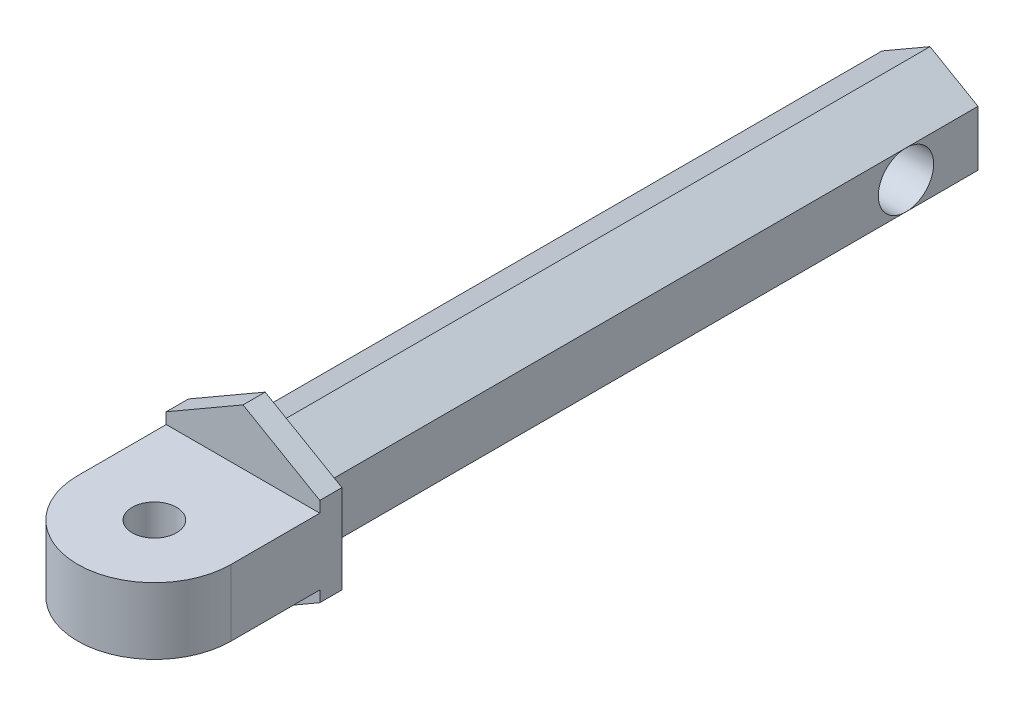
ISO-10303-21;
HEADER;
FILE_DESCRIPTION(('STEP AP214'),'2;1');
FILE_NAME('part.step','',(''),(''),'','','');
FILE_SCHEMA(('AUTOMOTIVE_DESIGN { 1 0 10303 214 1 1 1 1 }'));
ENDSEC;
DATA;
#1=APPLICATION_CONTEXT('core data for automotive mechanical design processes');
#2=APPLICATION_PROTOCOL_DEFINITION('international standard','automotive_design',2000,#1);
#3=PRODUCT_CONTEXT('',#1,'mechanical');
#4=PRODUCT('Part','Part','',(#3));
#5=PRODUCT_RELATED_PRODUCT_CATEGORY('part','',(#4));
#6=PRODUCT_DEFINITION_FORMATION('','',#4);
#7=PRODUCT_DEFINITION_CONTEXT('part definition',#1,'design');
#8=PRODUCT_DEFINITION('design','',#6,#7);
#9=PRODUCT_DEFINITION_SHAPE('','',#8);
#10=(LENGTH_UNIT() NAMED_UNIT(*) SI_UNIT(.MILLI.,.METRE.));
#11=(NAMED_UNIT(*) PLANE_ANGLE_UNIT() SI_UNIT($,.RADIAN.));
#12=(NAMED_UNIT(*) SI_UNIT($,.STERADIAN.) SOLID_ANGLE_UNIT());
#13=UNCERTAINTY_MEASURE_WITH_UNIT(LENGTH_MEASURE(1.E-05),#10,'distance_accuracy_value','');
#14=(GEOMETRIC_REPRESENTATION_CONTEXT(3) GLOBAL_UNCERTAINTY_ASSIGNED_CONTEXT((#13)) GLOBAL_UNIT_ASSIGNED_CONTEXT((#10,
#11,#12)) REPRESENTATION_CONTEXT('',''));
#15=CARTESIAN_POINT('',(0.,0.,0.));
#16=DIRECTION('',(0.,0.,1.));
#17=DIRECTION('',(1.,0.,0.));
#18=AXIS2_PLACEMENT_3D('',#15,#16,#17);
#19=CARTESIAN_POINT('',(2.1650635094611,1.25,-30.));
#20=DIRECTION('',(-1.,0.,0.));
#21=DIRECTION('',(0.,-1.,0.));
#22=AXIS2_PLACEMENT_3D('',#19,#20,#21);
#23=PLANE('',#22);
#24=DIRECTION('',(0.,0.,1.));
#25=VECTOR('',#24,1.);
#26=CARTESIAN_POINT('',(2.1650635094611,-1.25,-30.));
#27=LINE('',#26,#25);
#28=CARTESIAN_POINT('',(2.1650635094611,-1.25,-26.75));
#29=VERTEX_POINT('',#28);
#30=CARTESIAN_POINT('',(2.1650635094611,-1.25,0.));
#31=VERTEX_POINT('',#30);
#32=EDGE_CURVE('E166',#29,#31,#27,.T.);
#33=ORIENTED_EDGE('',*,*,#32,.F.);
#34=CARTESIAN_POINT('',(2.1650635094611,0.,-26.75));
#35=DIRECTION('',(-1.,0.,0.));
#36=DIRECTION('',(0.,-1.,0.));
#37=AXIS2_PLACEMENT_3D('',#34,#35,#36);
#38=CIRCLE('',#37,1.25);
#39=CARTESIAN_POINT('',(2.1650635094611,1.25,-26.75));
#40=VERTEX_POINT('',#39);
#41=EDGE_CURVE('E46',#40,#29,#38,.F.);
#42=ORIENTED_EDGE('',*,*,#41,.F.);
#43=DIRECTION('',(0.,0.,1.));
#44=VECTOR('',#43,1.);
#45=CARTESIAN_POINT('',(2.1650635094611,1.25,-30.));
#46=LINE('',#45,#44);
#47=CARTESIAN_POINT('',(2.1650635094611,1.25,0.));
#48=VERTEX_POINT('',#47);
#49=EDGE_CURVE('E164',#40,#48,#46,.T.);
#50=ORIENTED_EDGE('',*,*,#49,.T.);
#51=DIRECTION('',(0.,-1.,0.));
#52=VECTOR('',#51,1.);
#53=CARTESIAN_POINT('',(2.1650635094611,1.25,0.));
#54=LINE('',#53,#52);
#55=EDGE_CURVE('E514',#48,#31,#54,.T.);
#56=ORIENTED_EDGE('',*,*,#55,.T.);
#57=EDGE_LOOP('',(#33,#42,#50,#56));
#58=FACE_BOUND('',#57,.T.);
#59=ADVANCED_FACE('F32',(#58),#23,.F.);
#60=CARTESIAN_POINT('',(-2.1650635094611,-1.25,-30.));
#61=DIRECTION('',(1.,0.,0.));
#62=DIRECTION('',(0.,1.,0.));
#63=AXIS2_PLACEMENT_3D('',#60,#61,#62);
#64=PLANE('',#63);
#65=DIRECTION('',(0.,0.,1.));
#66=VECTOR('',#65,1.);
#67=CARTESIAN_POINT('',(-2.1650635094611,1.25,-30.));
#68=LINE('',#67,#66);
#69=CARTESIAN_POINT('',(-2.1650635094611,1.25,-26.75));
#70=VERTEX_POINT('',#69);
#71=CARTESIAN_POINT('',(-2.1650635094611,1.25,0.));
#72=VERTEX_POINT('',#71);
#73=EDGE_CURVE('E503',#70,#72,#68,.T.);
#74=ORIENTED_EDGE('',*,*,#73,.F.);
#75=CARTESIAN_POINT('',(-2.1650635094611,0.,-26.75));
#76=DIRECTION('',(-1.,0.,0.));
#77=DIRECTION('',(0.,-1.,0.));
#78=AXIS2_PLACEMENT_3D('',#75,#76,#77);
#79=CIRCLE('',#78,1.25);
#80=CARTESIAN_POINT('',(-2.1650635094611,-1.25,-26.75));
#81=VERTEX_POINT('',#80);
#82=EDGE_CURVE('E53',#81,#70,#79,.T.);
#83=ORIENTED_EDGE('',*,*,#82,.F.);
#84=DIRECTION('',(0.,0.,1.));
#85=VECTOR('',#84,1.);
#86=CARTESIAN_POINT('',(-2.1650635094611,-1.25,-30.));
#87=LINE('',#86,#85);
#88=CARTESIAN_POINT('',(-2.1650635094611,-1.25,0.));
#89=VERTEX_POINT('',#88);
#90=EDGE_CURVE('E496',#81,#89,#87,.T.);
#91=ORIENTED_EDGE('',*,*,#90,.T.);
#92=DIRECTION('',(0.,1.,0.));
#93=VECTOR('',#92,1.);
#94=CARTESIAN_POINT('',(-2.1650635094611,-1.25,0.));
#95=LINE('',#94,#93);
#96=EDGE_CURVE('E504',#89,#72,#95,.T.);
#97=ORIENTED_EDGE('',*,*,#96,.T.);
#98=EDGE_LOOP('',(#74,#83,#91,#97));
#99=FACE_BOUND('',#98,.T.);
#100=ADVANCED_FACE('F320',(#99),#64,.F.);
#101=CARTESIAN_POINT('',(0.,0.,0.));
#102=DIRECTION('',(0.,0.,1.));
#103=DIRECTION('',(1.,0.,0.));
#104=AXIS2_PLACEMENT_3D('',#101,#102,#103);
#105=PLANE('',#104);
#106=DIRECTION('',(0.,1.,0.));
#107=VECTOR('',#106,1.);
#108=CARTESIAN_POINT('',(3.46410161513776,-1.99999999999999,0.));
#109=LINE('',#108,#107);
#110=CARTESIAN_POINT('',(3.46410161513776,-1.99999999999999,0.));
#111=VERTEX_POINT('',#110);
#112=CARTESIAN_POINT('',(3.46410161513775,2.00000000000001,0.));
#113=VERTEX_POINT('',#112);
#114=EDGE_CURVE('E215',#111,#113,#109,.T.);
#115=ORIENTED_EDGE('',*,*,#114,.F.);
#116=DIRECTION('',(0.866025403784436,0.500000000000004,0.));
#117=VECTOR('',#116,1.);
#118=CARTESIAN_POINT('',(0.,-4.,0.));
#119=LINE('',#118,#117);
#120=CARTESIAN_POINT('',(0.,-4.,0.));
#121=VERTEX_POINT('',#120);
#122=EDGE_CURVE('E244',#121,#111,#119,.T.);
#123=ORIENTED_EDGE('',*,*,#122,.F.);
#124=DIRECTION('',(0.866025403784441,-0.499999999999995,0.));
#125=VECTOR('',#124,1.);
#126=CARTESIAN_POINT('',(-3.46410161513775,-2.00000000000001,0.));
#127=LINE('',#126,#125);
#128=CARTESIAN_POINT('',(-3.46410161513775,-2.00000000000001,0.));
#129=VERTEX_POINT('',#128);
#130=EDGE_CURVE('E242',#129,#121,#127,.T.);
#131=ORIENTED_EDGE('',*,*,#130,.F.);
#132=DIRECTION('',(0.,-1.,0.));
#133=VECTOR('',#132,1.);
#134=CARTESIAN_POINT('',(-3.46410161513776,1.99999999999999,0.));
#135=LINE('',#134,#133);
#136=CARTESIAN_POINT('',(-3.46410161513776,1.99999999999999,0.));
#137=VERTEX_POINT('',#136);
#138=EDGE_CURVE('E240',#137,#129,#135,.T.);
#139=ORIENTED_EDGE('',*,*,#138,.F.);
#140=DIRECTION('',(-0.866025403784438,-0.500000000000001,0.));
#141=VECTOR('',#140,1.);
#142=CARTESIAN_POINT('',(0.,4.,0.));
#143=LINE('',#142,#141);
#144=CARTESIAN_POINT('',(0.,4.,0.));
#145=VERTEX_POINT('',#144);
#146=EDGE_CURVE('E238',#145,#137,#143,.T.);
#147=ORIENTED_EDGE('',*,*,#146,.F.);
#148=DIRECTION('',(-0.86602540378444,0.499999999999998,0.));
#149=VECTOR('',#148,1.);
#150=CARTESIAN_POINT('',(3.46410161513775,2.00000000000001,0.));
#151=LINE('',#150,#149);
#152=EDGE_CURVE('E236',#113,#145,#151,.T.);
#153=ORIENTED_EDGE('',*,*,#152,.F.);
#154=EDGE_LOOP('',(#115,#123,#131,#139,#147,#153));
#155=FACE_BOUND('',#154,.T.);
#156=DIRECTION('',(0.866025403784439,0.5,0.));
#157=VECTOR('',#156,1.);
#158=CARTESIAN_POINT('',(-2.1650635094611,1.25,0.));
#159=LINE('',#158,#157);
#160=CARTESIAN_POINT('',(0.,2.5,0.));
#161=VERTEX_POINT('',#160);
#162=EDGE_CURVE('E159',#72,#161,#159,.T.);
#163=ORIENTED_EDGE('',*,*,#162,.F.);
#164=ORIENTED_EDGE('',*,*,#96,.F.);
#165=DIRECTION('',(-0.866025403784439,0.5,0.));
#166=VECTOR('',#165,1.);
#167=CARTESIAN_POINT('',(0.,-2.5,0.));
#168=LINE('',#167,#166);
#169=CARTESIAN_POINT('',(0.,-2.5,0.));
#170=VERTEX_POINT('',#169);
#171=EDGE_CURVE('E508',#170,#89,#168,.T.);
#172=ORIENTED_EDGE('',*,*,#171,.F.);
#173=DIRECTION('',(-0.866025403784439,-0.5,0.));
#174=VECTOR('',#173,1.);
#175=CARTESIAN_POINT('',(2.1650635094611,-1.25,0.));
#176=LINE('',#175,#174);
#177=EDGE_CURVE('E511',#31,#170,#176,.T.);
#178=ORIENTED_EDGE('',*,*,#177,.F.);
#179=ORIENTED_EDGE('',*,*,#55,.F.);
#180=DIRECTION('',(0.866025403784439,-0.5,0.));
#181=VECTOR('',#180,1.);
#182=CARTESIAN_POINT('',(0.,2.5,0.));
#183=LINE('',#182,#181);
#184=EDGE_CURVE('E175',#161,#48,#183,.T.);
#185=ORIENTED_EDGE('',*,*,#184,.F.);
#186=EDGE_LOOP('',(#163,#164,#172,#178,#179,#185));
#187=FACE_BOUND('',#186,.T.);
#188=ADVANCED_FACE('F272',(#155,#187),#105,.F.);
#189=CARTESIAN_POINT('',(0.,0.,1.));
#190=DIRECTION('',(0.,0.,1.));
#191=DIRECTION('',(1.,0.,0.));
#192=AXIS2_PLACEMENT_3D('',#189,#190,#191);
#193=PLANE('',#192);
#194=DIRECTION('',(0.,1.,0.));
#195=VECTOR('',#194,1.);
#196=CARTESIAN_POINT('',(3.46410161513776,-1.99999999999999,1.));
#197=LINE('',#196,#195);
#198=CARTESIAN_POINT('',(3.46410161513776,-1.99999999999999,1.));
#199=VERTEX_POINT('',#198);
#200=CARTESIAN_POINT('',(3.46410161513775,-1.5,1.));
#201=VERTEX_POINT('',#200);
#202=EDGE_CURVE('E217',#199,#201,#197,.T.);
#203=ORIENTED_EDGE('',*,*,#202,.T.);
#204=DIRECTION('',(-1.,0.,0.));
#205=VECTOR('',#204,1.);
#206=CARTESIAN_POINT('',(-3.46410161513776,-1.5,1.));
#207=LINE('',#206,#205);
#208=CARTESIAN_POINT('',(-3.46410161513775,-1.5,1.));
#209=VERTEX_POINT('',#208);
#210=EDGE_CURVE('E209',#201,#209,#207,.T.);
#211=ORIENTED_EDGE('',*,*,#210,.T.);
#212=DIRECTION('',(0.,-1.,0.));
#213=VECTOR('',#212,1.);
#214=CARTESIAN_POINT('',(-3.46410161513776,1.99999999999999,1.));
#215=LINE('',#214,#213);
#216=CARTESIAN_POINT('',(-3.46410161513775,-2.00000000000001,1.));
#217=VERTEX_POINT('',#216);
#218=EDGE_CURVE('E225',#209,#217,#215,.T.);
#219=ORIENTED_EDGE('',*,*,#218,.T.);
#220=DIRECTION('',(0.866025403784441,-0.499999999999995,0.));
#221=VECTOR('',#220,1.);
#222=CARTESIAN_POINT('',(-3.46410161513775,-2.00000000000001,1.));
#223=LINE('',#222,#221);
#224=CARTESIAN_POINT('',(0.,-4.,1.));
#225=VERTEX_POINT('',#224);
#226=EDGE_CURVE('E229',#217,#225,#223,.T.);
#227=ORIENTED_EDGE('',*,*,#226,.T.);
#228=DIRECTION('',(0.866025403784436,0.500000000000004,0.));
#229=VECTOR('',#228,1.);
#230=CARTESIAN_POINT('',(0.,-4.,1.));
#231=LINE('',#230,#229);
#232=EDGE_CURVE('E231',#225,#199,#231,.T.);
#233=ORIENTED_EDGE('',*,*,#232,.T.);
#234=EDGE_LOOP('',(#203,#211,#219,#227,#233));
#235=FACE_BOUND('',#234,.T.);
#236=ADVANCED_FACE('F304',(#235),#193,.T.);
#237=CARTESIAN_POINT('',(3.46410161513776,-1.99999999999999,1.));
#238=DIRECTION('',(-1.,0.,0.));
#239=DIRECTION('',(0.,-1.,0.));
#240=AXIS2_PLACEMENT_3D('',#237,#238,#239);
#241=PLANE('',#240);
#242=ORIENTED_EDGE('',*,*,#114,.T.);
#243=DIRECTION('',(0.,0.,-1.));
#244=VECTOR('',#243,1.);
#245=CARTESIAN_POINT('',(3.46410161513775,2.00000000000001,1.));
#246=LINE('',#245,#244);
#247=CARTESIAN_POINT('',(3.46410161513775,2.00000000000001,1.));
#248=VERTEX_POINT('',#247);
#249=EDGE_CURVE('E40',#248,#113,#246,.T.);
#250=ORIENTED_EDGE('',*,*,#249,.F.);
#251=CARTESIAN_POINT('',(3.46410161513775,1.5,1.));
#252=VERTEX_POINT('',#251);
#253=EDGE_CURVE('E221',#252,#248,#197,.T.);
#254=ORIENTED_EDGE('',*,*,#253,.F.);
#255=DIRECTION('',(0.,0.,-1.));
#256=VECTOR('',#255,1.);
#257=CARTESIAN_POINT('',(3.46410161513775,1.5,1.));
#258=LINE('',#257,#256);
#259=CARTESIAN_POINT('',(3.46410161513775,1.5,5.));
#260=VERTEX_POINT('',#259);
#261=EDGE_CURVE('E194',#260,#252,#258,.T.);
#262=ORIENTED_EDGE('',*,*,#261,.F.);
#263=DIRECTION('',(0.,1.,0.));
#264=VECTOR('',#263,1.);
#265=CARTESIAN_POINT('',(3.46410161513775,-1.5,5.));
#266=LINE('',#265,#264);
#267=CARTESIAN_POINT('',(3.46410161513775,-1.5,5.));
#268=VERTEX_POINT('',#267);
#269=EDGE_CURVE('E213',#268,#260,#266,.T.);
#270=ORIENTED_EDGE('',*,*,#269,.F.);
#271=DIRECTION('',(0.,0.,-1.));
#272=VECTOR('',#271,1.);
#273=CARTESIAN_POINT('',(3.46410161513775,-1.5,1.));
#274=LINE('',#273,#272);
#275=EDGE_CURVE('E207',#268,#201,#274,.T.);
#276=ORIENTED_EDGE('',*,*,#275,.T.);
#277=ORIENTED_EDGE('',*,*,#202,.F.);
#278=DIRECTION('',(0.,0.,-1.));
#279=VECTOR('',#278,1.);
#280=CARTESIAN_POINT('',(3.46410161513776,-1.99999999999999,1.));
#281=LINE('',#280,#279);
#282=EDGE_CURVE('E233',#199,#111,#281,.T.);
#283=ORIENTED_EDGE('',*,*,#282,.T.);
#284=EDGE_LOOP('',(#242,#250,#254,#262,#270,#276,#277,#283));
#285=FACE_BOUND('',#284,.T.);
#286=ADVANCED_FACE('F34',(#285),#241,.F.);
#287=CARTESIAN_POINT('',(3.46410161513775,2.00000000000001,1.));
#288=DIRECTION('',(-0.499999999999998,-0.86602540378444,0.));
#289=DIRECTION('',(0.86602540378444,-0.499999999999998,0.));
#290=AXIS2_PLACEMENT_3D('',#287,#288,#289);
#291=PLANE('',#290);
#292=ORIENTED_EDGE('',*,*,#152,.T.);
#293=DIRECTION('',(0.,0.,-1.));
#294=VECTOR('',#293,1.);
#295=CARTESIAN_POINT('',(0.,4.,1.));
#296=LINE('',#295,#294);
#297=CARTESIAN_POINT('',(0.,4.,1.));
#298=VERTEX_POINT('',#297);
#299=EDGE_CURVE('E257',#298,#145,#296,.T.);
#300=ORIENTED_EDGE('',*,*,#299,.F.);
#301=DIRECTION('',(-0.86602540378444,0.499999999999998,0.));
#302=VECTOR('',#301,1.);
#303=CARTESIAN_POINT('',(3.46410161513775,2.00000000000001,1.));
#304=LINE('',#303,#302);
#305=EDGE_CURVE('E220',#248,#298,#304,.T.);
#306=ORIENTED_EDGE('',*,*,#305,.F.);
#307=ORIENTED_EDGE('',*,*,#249,.T.);
#308=EDGE_LOOP('',(#292,#300,#306,#307));
#309=FACE_BOUND('',#308,.T.);
#310=ADVANCED_FACE('F263',(#309),#291,.F.);
#311=CARTESIAN_POINT('',(0.,4.,1.));
#312=DIRECTION('',(0.500000000000001,-0.866025403784438,0.));
#313=DIRECTION('',(0.866025403784438,0.500000000000001,0.));
#314=AXIS2_PLACEMENT_3D('',#311,#312,#313);
#315=PLANE('',#314);
#316=ORIENTED_EDGE('',*,*,#146,.T.);
#317=DIRECTION('',(0.,0.,-1.));
#318=VECTOR('',#317,1.);
#319=CARTESIAN_POINT('',(-3.46410161513776,1.99999999999999,1.));
#320=LINE('',#319,#318);
#321=CARTESIAN_POINT('',(-3.46410161513776,1.99999999999999,1.));
#322=VERTEX_POINT('',#321);
#323=EDGE_CURVE('E254',#322,#137,#320,.T.);
#324=ORIENTED_EDGE('',*,*,#323,.F.);
#325=DIRECTION('',(-0.866025403784438,-0.500000000000001,0.));
#326=VECTOR('',#325,1.);
#327=CARTESIAN_POINT('',(0.,4.,1.));
#328=LINE('',#327,#326);
#329=EDGE_CURVE('E223',#298,#322,#328,.T.);
#330=ORIENTED_EDGE('',*,*,#329,.F.);
#331=ORIENTED_EDGE('',*,*,#299,.T.);
#332=EDGE_LOOP('',(#316,#324,#330,#331));
#333=FACE_BOUND('',#332,.T.);
#334=ADVANCED_FACE('F279',(#333),#315,.F.);
#335=CARTESIAN_POINT('',(-3.46410161513776,1.99999999999999,1.));
#336=DIRECTION('',(1.,0.,0.));
#337=DIRECTION('',(0.,1.,0.));
#338=AXIS2_PLACEMENT_3D('',#335,#336,#337);
#339=PLANE('',#338);
#340=ORIENTED_EDGE('',*,*,#138,.T.);
#341=DIRECTION('',(0.,0.,-1.));
#342=VECTOR('',#341,1.);
#343=CARTESIAN_POINT('',(-3.46410161513775,-2.00000000000001,1.));
#344=LINE('',#343,#342);
#345=EDGE_CURVE('E251',#217,#129,#344,.T.);
#346=ORIENTED_EDGE('',*,*,#345,.F.);
#347=ORIENTED_EDGE('',*,*,#218,.F.);
#348=DIRECTION('',(0.,0.,1.));
#349=VECTOR('',#348,1.);
#350=CARTESIAN_POINT('',(-3.46410161513776,-1.5,1.));
#351=LINE('',#350,#349);
#352=CARTESIAN_POINT('',(-3.46410161513776,-1.5,5.));
#353=VERTEX_POINT('',#352);
#354=EDGE_CURVE('E201',#209,#353,#351,.T.);
#355=ORIENTED_EDGE('',*,*,#354,.T.);
#356=DIRECTION('',(0.,1.,0.));
#357=VECTOR('',#356,1.);
#358=CARTESIAN_POINT('',(-3.46410161513776,-1.5,5.));
#359=LINE('',#358,#357);
#360=CARTESIAN_POINT('',(-3.46410161513776,1.5,5.));
#361=VERTEX_POINT('',#360);
#362=EDGE_CURVE('E212',#353,#361,#359,.T.);
#363=ORIENTED_EDGE('',*,*,#362,.T.);
#364=DIRECTION('',(0.,0.,1.));
#365=VECTOR('',#364,1.);
#366=CARTESIAN_POINT('',(-3.46410161513776,1.5,1.));
#367=LINE('',#366,#365);
#368=CARTESIAN_POINT('',(-3.46410161513776,1.5,1.));
#369=VERTEX_POINT('',#368);
#370=EDGE_CURVE('E188',#369,#361,#367,.T.);
#371=ORIENTED_EDGE('',*,*,#370,.F.);
#372=EDGE_CURVE('E226',#322,#369,#215,.T.);
#373=ORIENTED_EDGE('',*,*,#372,.F.);
#374=ORIENTED_EDGE('',*,*,#323,.T.);
#375=EDGE_LOOP('',(#340,#346,#347,#355,#363,#371,#373,#374));
#376=FACE_BOUND('',#375,.T.);
#377=ADVANCED_FACE('F283',(#376),#339,.F.);
#378=CARTESIAN_POINT('',(-3.46410161513775,-2.00000000000001,1.));
#379=DIRECTION('',(0.499999999999995,0.866025403784441,0.));
#380=DIRECTION('',(-0.866025403784441,0.499999999999995,0.));
#381=AXIS2_PLACEMENT_3D('',#378,#379,#380);
#382=PLANE('',#381);
#383=ORIENTED_EDGE('',*,*,#130,.T.);
#384=DIRECTION('',(0.,0.,-1.));
#385=VECTOR('',#384,1.);
#386=CARTESIAN_POINT('',(0.,-4.,1.));
#387=LINE('',#386,#385);
#388=EDGE_CURVE('E248',#225,#121,#387,.T.);
#389=ORIENTED_EDGE('',*,*,#388,.F.);
#390=ORIENTED_EDGE('',*,*,#226,.F.);
#391=ORIENTED_EDGE('',*,*,#345,.T.);
#392=EDGE_LOOP('',(#383,#389,#390,#391));
#393=FACE_BOUND('',#392,.T.);
#394=ADVANCED_FACE('F310',(#393),#382,.F.);
#395=CARTESIAN_POINT('',(0.,-4.,1.));
#396=DIRECTION('',(-0.500000000000004,0.866025403784436,0.));
#397=DIRECTION('',(-0.866025403784436,-0.500000000000004,0.));
#398=AXIS2_PLACEMENT_3D('',#395,#396,#397);
#399=PLANE('',#398);
#400=ORIENTED_EDGE('',*,*,#122,.T.);
#401=ORIENTED_EDGE('',*,*,#282,.F.);
#402=ORIENTED_EDGE('',*,*,#232,.F.);
#403=ORIENTED_EDGE('',*,*,#388,.T.);
#404=EDGE_LOOP('',(#400,#401,#402,#403));
#405=FACE_BOUND('',#404,.T.);
#406=ADVANCED_FACE('F308',(#405),#399,.F.);
#407=DIRECTION('',(-1.,0.,0.));
#408=VECTOR('',#407,1.);
#409=CARTESIAN_POINT('',(-3.46410161513776,1.5,1.));
#410=LINE('',#409,#408);
#411=EDGE_CURVE('E196',#252,#369,#410,.T.);
#412=ORIENTED_EDGE('',*,*,#411,.F.);
#413=ORIENTED_EDGE('',*,*,#253,.T.);
#414=ORIENTED_EDGE('',*,*,#305,.T.);
#415=ORIENTED_EDGE('',*,*,#329,.T.);
#416=ORIENTED_EDGE('',*,*,#372,.T.);
#417=EDGE_LOOP('',(#412,#413,#414,#415,#416));
#418=FACE_BOUND('',#417,.T.);
#419=ADVANCED_FACE('F288',(#418),#193,.T.);
#420=CARTESIAN_POINT('',(0.,-1.5,5.));
#421=DIRECTION('',(0.,1.,0.));
#422=DIRECTION('',(0.,0.,1.));
#423=AXIS2_PLACEMENT_3D('',#420,#421,#422);
#424=CYLINDRICAL_SURFACE('',#423,3.46410161513775);
#425=ORIENTED_EDGE('',*,*,#269,.T.);
#426=CARTESIAN_POINT('',(0.,1.5,5.));
#427=DIRECTION('',(0.,1.,0.));
#428=DIRECTION('',(0.,0.,1.));
#429=AXIS2_PLACEMENT_3D('',#426,#427,#428);
#430=CIRCLE('',#429,3.46410161513775);
#431=EDGE_CURVE('E191',#361,#260,#430,.T.);
#432=ORIENTED_EDGE('',*,*,#431,.F.);
#433=ORIENTED_EDGE('',*,*,#362,.F.);
#434=CARTESIAN_POINT('',(0.,-1.5,5.));
#435=DIRECTION('',(0.,1.,0.));
#436=DIRECTION('',(0.,0.,1.));
#437=AXIS2_PLACEMENT_3D('',#434,#435,#436);
#438=CIRCLE('',#437,3.46410161513775);
#439=EDGE_CURVE('E204',#353,#268,#438,.T.);
#440=ORIENTED_EDGE('',*,*,#439,.T.);
#441=EDGE_LOOP('',(#425,#432,#433,#440));
#442=FACE_BOUND('',#441,.T.);
#443=ADVANCED_FACE('F296',(#442),#424,.T.);
#444=CARTESIAN_POINT('',(0.,-1.5,5.));
#445=DIRECTION('',(0.,1.,0.));
#446=DIRECTION('',(0.,0.,1.));
#447=AXIS2_PLACEMENT_3D('',#444,#445,#446);
#448=PLANE('',#447);
#449=CARTESIAN_POINT('',(0.,-1.5,5.));
#450=DIRECTION('',(0.,1.,0.));
#451=DIRECTION('',(0.,0.,1.));
#452=AXIS2_PLACEMENT_3D('',#449,#450,#451);
#453=CIRCLE('',#452,1.);
#454=CARTESIAN_POINT('',(0.,-1.5,6.));
#455=VERTEX_POINT('',#454);
#456=EDGE_CURVE('E198',#455,#455,#453,.T.);
#457=ORIENTED_EDGE('',*,*,#456,.T.);
#458=EDGE_LOOP('',(#457));
#459=FACE_BOUND('',#458,.T.);
#460=ORIENTED_EDGE('',*,*,#354,.F.);
#461=ORIENTED_EDGE('',*,*,#210,.F.);
#462=ORIENTED_EDGE('',*,*,#275,.F.);
#463=ORIENTED_EDGE('',*,*,#439,.F.);
#464=EDGE_LOOP('',(#460,#461,#462,#463));
#465=FACE_BOUND('',#464,.T.);
#466=ADVANCED_FACE('F299',(#459,#465),#448,.F.);
#467=CARTESIAN_POINT('',(0.,-1.5,5.));
#468=DIRECTION('',(0.,1.,0.));
#469=DIRECTION('',(0.,0.,1.));
#470=AXIS2_PLACEMENT_3D('',#467,#468,#469);
#471=CYLINDRICAL_SURFACE('',#470,1.);
#472=ORIENTED_EDGE('',*,*,#456,.F.);
#473=EDGE_LOOP('',(#472));
#474=FACE_BOUND('',#473,.T.);
#475=CARTESIAN_POINT('',(0.,1.5,5.));
#476=DIRECTION('',(0.,1.,0.));
#477=DIRECTION('',(0.,0.,1.));
#478=AXIS2_PLACEMENT_3D('',#475,#476,#477);
#479=CIRCLE('',#478,1.);
#480=CARTESIAN_POINT('',(0.,1.5,6.));
#481=VERTEX_POINT('',#480);
#482=EDGE_CURVE('E181',#481,#481,#479,.T.);
#483=ORIENTED_EDGE('',*,*,#482,.T.);
#484=EDGE_LOOP('',(#483));
#485=FACE_BOUND('',#484,.T.);
#486=ADVANCED_FACE('F347',(#474,#485),#471,.F.);
#487=CARTESIAN_POINT('',(0.,1.5,5.));
#488=DIRECTION('',(0.,1.,0.));
#489=DIRECTION('',(0.,0.,1.));
#490=AXIS2_PLACEMENT_3D('',#487,#488,#489);
#491=PLANE('',#490);
#492=ORIENTED_EDGE('',*,*,#370,.T.);
#493=ORIENTED_EDGE('',*,*,#431,.T.);
#494=ORIENTED_EDGE('',*,*,#261,.T.);
#495=ORIENTED_EDGE('',*,*,#411,.T.);
#496=EDGE_LOOP('',(#492,#493,#494,#495));
#497=FACE_BOUND('',#496,.T.);
#498=ORIENTED_EDGE('',*,*,#482,.F.);
#499=EDGE_LOOP('',(#498));
#500=FACE_BOUND('',#499,.T.);
#501=ADVANCED_FACE('F292',(#497,#500),#491,.T.);
#502=CARTESIAN_POINT('',(-2.1650635094611,1.25,-30.));
#503=DIRECTION('',(0.5,-0.866025403784439,0.));
#504=DIRECTION('',(0.866025403784439,0.5,0.));
#505=AXIS2_PLACEMENT_3D('',#502,#503,#504);
#506=PLANE('',#505);
#507=ORIENTED_EDGE('',*,*,#162,.T.);
#508=DIRECTION('',(0.,0.,1.));
#509=VECTOR('',#508,1.);
#510=CARTESIAN_POINT('',(0.,2.5,-30.));
#511=LINE('',#510,#509);
#512=CARTESIAN_POINT('',(0.,2.5,-30.));
#513=VERTEX_POINT('',#512);
#514=EDGE_CURVE('E180',#513,#161,#511,.T.);
#515=ORIENTED_EDGE('',*,*,#514,.F.);
#516=DIRECTION('',(0.866025403784439,0.5,0.));
#517=VECTOR('',#516,1.);
#518=CARTESIAN_POINT('',(-2.1650635094611,1.25,-30.));
#519=LINE('',#518,#517);
#520=CARTESIAN_POINT('',(-2.1650635094611,1.25,-30.));
#521=VERTEX_POINT('',#520);
#522=EDGE_CURVE('E507',#521,#513,#519,.T.);
#523=ORIENTED_EDGE('',*,*,#522,.F.);
#524=EDGE_CURVE('E499',#521,#70,#68,.T.);
#525=ORIENTED_EDGE('',*,*,#524,.T.);
#526=ORIENTED_EDGE('',*,*,#73,.T.);
#527=EDGE_LOOP('',(#507,#515,#523,#525,#526));
#528=FACE_BOUND('',#527,.T.);
#529=ADVANCED_FACE('F338',(#528),#506,.F.);
#530=CARTESIAN_POINT('',(0.,2.5,-30.));
#531=DIRECTION('',(-0.5,-0.866025403784439,0.));
#532=DIRECTION('',(0.866025403784439,-0.5,0.));
#533=AXIS2_PLACEMENT_3D('',#530,#531,#532);
#534=PLANE('',#533);
#535=ORIENTED_EDGE('',*,*,#184,.T.);
#536=ORIENTED_EDGE('',*,*,#49,.F.);
#537=CARTESIAN_POINT('',(2.1650635094611,1.25,-30.));
#538=VERTEX_POINT('',#537);
#539=EDGE_CURVE('E172',#538,#40,#46,.T.);
#540=ORIENTED_EDGE('',*,*,#539,.F.);
#541=DIRECTION('',(0.866025403784439,-0.5,0.));
#542=VECTOR('',#541,1.);
#543=CARTESIAN_POINT('',(0.,2.5,-30.));
#544=LINE('',#543,#542);
#545=EDGE_CURVE('E525',#513,#538,#544,.T.);
#546=ORIENTED_EDGE('',*,*,#545,.F.);
#547=ORIENTED_EDGE('',*,*,#514,.T.);
#548=EDGE_LOOP('',(#535,#536,#540,#546,#547));
#549=FACE_BOUND('',#548,.T.);
#550=ADVANCED_FACE('F171',(#549),#534,.F.);
#551=ORIENTED_EDGE('',*,*,#539,.T.);
#552=EDGE_CURVE('E153',#29,#40,#38,.F.);
#553=ORIENTED_EDGE('',*,*,#552,.F.);
#554=CARTESIAN_POINT('',(2.1650635094611,-1.25,-30.));
#555=VERTEX_POINT('',#554);
#556=EDGE_CURVE('E176',#555,#29,#27,.T.);
#557=ORIENTED_EDGE('',*,*,#556,.F.);
#558=DIRECTION('',(0.,-1.,0.));
#559=VECTOR('',#558,1.);
#560=CARTESIAN_POINT('',(2.1650635094611,1.25,-30.));
#561=LINE('',#560,#559);
#562=EDGE_CURVE('E179',#538,#555,#561,.T.);
#563=ORIENTED_EDGE('',*,*,#562,.F.);
#564=EDGE_LOOP('',(#551,#553,#557,#563));
#565=FACE_BOUND('',#564,.T.);
#566=ADVANCED_FACE('F178',(#565),#23,.F.);
#567=CARTESIAN_POINT('',(2.1650635094611,-1.25,-30.));
#568=DIRECTION('',(-0.5,0.866025403784439,0.));
#569=DIRECTION('',(-0.866025403784439,-0.5,0.));
#570=AXIS2_PLACEMENT_3D('',#567,#568,#569);
#571=PLANE('',#570);
#572=ORIENTED_EDGE('',*,*,#177,.T.);
#573=DIRECTION('',(0.,0.,1.));
#574=VECTOR('',#573,1.);
#575=CARTESIAN_POINT('',(0.,-2.5,-30.));
#576=LINE('',#575,#574);
#577=CARTESIAN_POINT('',(0.,-2.5,-30.));
#578=VERTEX_POINT('',#577);
#579=EDGE_CURVE('E495',#578,#170,#576,.T.);
#580=ORIENTED_EDGE('',*,*,#579,.F.);
#581=DIRECTION('',(-0.866025403784439,-0.5,0.));
#582=VECTOR('',#581,1.);
#583=CARTESIAN_POINT('',(2.1650635094611,-1.25,-30.));
#584=LINE('',#583,#582);
#585=EDGE_CURVE('E522',#555,#578,#584,.T.);
#586=ORIENTED_EDGE('',*,*,#585,.F.);
#587=ORIENTED_EDGE('',*,*,#556,.T.);
#588=ORIENTED_EDGE('',*,*,#32,.T.);
#589=EDGE_LOOP('',(#572,#580,#586,#587,#588));
#590=FACE_BOUND('',#589,.T.);
#591=ADVANCED_FACE('F331',(#590),#571,.F.);
#592=CARTESIAN_POINT('',(0.,-2.5,-30.));
#593=DIRECTION('',(0.5,0.866025403784439,0.));
#594=DIRECTION('',(-0.866025403784439,0.5,0.));
#595=AXIS2_PLACEMENT_3D('',#592,#593,#594);
#596=PLANE('',#595);
#597=ORIENTED_EDGE('',*,*,#171,.T.);
#598=ORIENTED_EDGE('',*,*,#90,.F.);
#599=CARTESIAN_POINT('',(-2.1650635094611,-1.25,-30.));
#600=VERTEX_POINT('',#599);
#601=EDGE_CURVE('E489',#600,#81,#87,.T.);
#602=ORIENTED_EDGE('',*,*,#601,.F.);
#603=DIRECTION('',(-0.866025403784439,0.5,0.));
#604=VECTOR('',#603,1.);
#605=CARTESIAN_POINT('',(0.,-2.5,-30.));
#606=LINE('',#605,#604);
#607=EDGE_CURVE('E520',#578,#600,#606,.T.);
#608=ORIENTED_EDGE('',*,*,#607,.F.);
#609=ORIENTED_EDGE('',*,*,#579,.T.);
#610=EDGE_LOOP('',(#597,#598,#602,#608,#609));
#611=FACE_BOUND('',#610,.T.);
#612=ADVANCED_FACE('F336',(#611),#596,.F.);
#613=ORIENTED_EDGE('',*,*,#601,.T.);
#614=CARTESIAN_POINT('',(-2.1650635094611,0.,-26.75));
#615=DIRECTION('',(1.,0.,0.));
#616=DIRECTION('',(0.,1.,0.));
#617=AXIS2_PLACEMENT_3D('',#614,#615,#616);
#618=CIRCLE('',#617,1.25);
#619=EDGE_CURVE('E11',#81,#70,#618,.T.);
#620=ORIENTED_EDGE('',*,*,#619,.T.);
#621=ORIENTED_EDGE('',*,*,#524,.F.);
#622=DIRECTION('',(0.,1.,0.));
#623=VECTOR('',#622,1.);
#624=CARTESIAN_POINT('',(-2.1650635094611,-1.25,-30.));
#625=LINE('',#624,#623);
#626=EDGE_CURVE('E492',#600,#521,#625,.T.);
#627=ORIENTED_EDGE('',*,*,#626,.F.);
#628=EDGE_LOOP('',(#613,#620,#621,#627));
#629=FACE_BOUND('',#628,.T.);
#630=ADVANCED_FACE('F327',(#629),#64,.F.);
#631=CARTESIAN_POINT('',(0.,0.,-30.));
#632=DIRECTION('',(0.,0.,-1.));
#633=DIRECTION('',(-1.,0.,0.));
#634=AXIS2_PLACEMENT_3D('',#631,#632,#633);
#635=PLANE('',#634);
#636=ORIENTED_EDGE('',*,*,#522,.T.);
#637=ORIENTED_EDGE('',*,*,#545,.T.);
#638=ORIENTED_EDGE('',*,*,#562,.T.);
#639=ORIENTED_EDGE('',*,*,#585,.T.);
#640=ORIENTED_EDGE('',*,*,#607,.T.);
#641=ORIENTED_EDGE('',*,*,#626,.T.);
#642=EDGE_LOOP('',(#636,#637,#638,#639,#640,#641));
#643=FACE_BOUND('',#642,.T.);
#644=ADVANCED_FACE('F423',(#643),#635,.T.);
#645=CARTESIAN_POINT('',(5.70059741539384,0.,-26.75));
#646=DIRECTION('',(-1.,0.,0.));
#647=DIRECTION('',(0.,-1.,0.));
#648=AXIS2_PLACEMENT_3D('',#645,#646,#647);
#649=CYLINDRICAL_SURFACE('',#648,1.25);
#650=ORIENTED_EDGE('',*,*,#552,.T.);
#651=ORIENTED_EDGE('',*,*,#41,.T.);
#652=EDGE_LOOP('',(#650,#651));
#653=FACE_BOUND('',#652,.T.);
#654=ORIENTED_EDGE('',*,*,#82,.T.);
#655=ORIENTED_EDGE('',*,*,#619,.F.);
#656=EDGE_LOOP('',(#654,#655));
#657=FACE_BOUND('',#656,.T.);
#658=ADVANCED_FACE('F154',(#653,#657),#649,.F.);
#659=CLOSED_SHELL('',(#59,#100,#188,#236,#286,#310,#334,#377,#394,#406,#419,#443,#466,#486,#501,
#529,#550,#566,#591,#612,#630,#644,#658));
#660=MANIFOLD_SOLID_BREP('B2',#659);
#661=ADVANCED_BREP_SHAPE_REPRESENTATION('',(#18,#660),#14);
#662=SHAPE_DEFINITION_REPRESENTATION(#9,#661);
ENDSEC;
END-ISO-10303-21;
